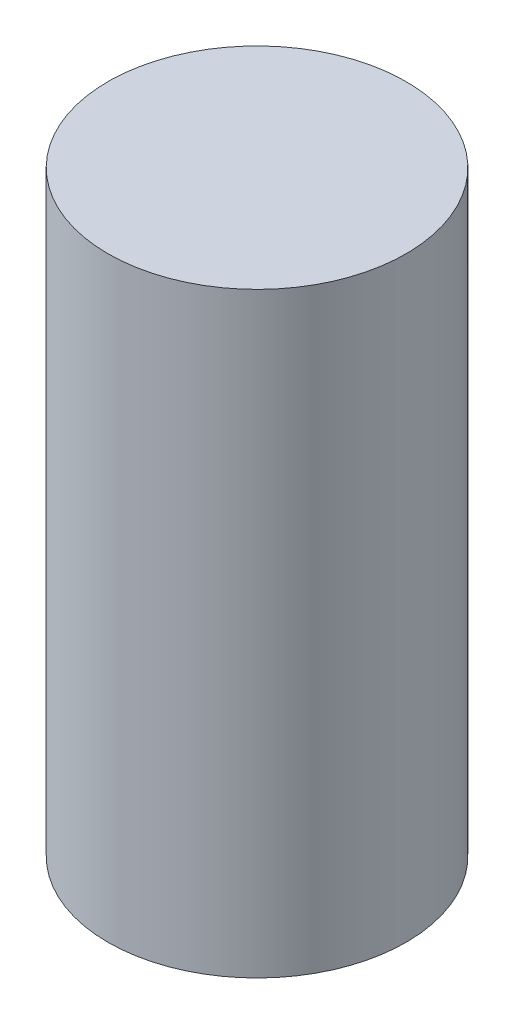
ISO-10303-21;
HEADER;
FILE_DESCRIPTION(('STEP AP214'),'2;1');
FILE_NAME('part.step','',(''),(''),'','','');
FILE_SCHEMA(('AUTOMOTIVE_DESIGN { 1 0 10303 214 1 1 1 1 }'));
ENDSEC;
DATA;
#1=APPLICATION_CONTEXT('core data for automotive mechanical design processes');
#2=APPLICATION_PROTOCOL_DEFINITION('international standard','automotive_design',2000,#1);
#3=PRODUCT_CONTEXT('',#1,'mechanical');
#4=PRODUCT('Part','Part','',(#3));
#5=PRODUCT_RELATED_PRODUCT_CATEGORY('part','',(#4));
#6=PRODUCT_DEFINITION_FORMATION('','',#4);
#7=PRODUCT_DEFINITION_CONTEXT('part definition',#1,'design');
#8=PRODUCT_DEFINITION('design','',#6,#7);
#9=PRODUCT_DEFINITION_SHAPE('','',#8);
#10=(LENGTH_UNIT() NAMED_UNIT(*) SI_UNIT(.MILLI.,.METRE.));
#11=(NAMED_UNIT(*) PLANE_ANGLE_UNIT() SI_UNIT($,.RADIAN.));
#12=(NAMED_UNIT(*) SI_UNIT($,.STERADIAN.) SOLID_ANGLE_UNIT());
#13=UNCERTAINTY_MEASURE_WITH_UNIT(LENGTH_MEASURE(1.E-05),#10,'distance_accuracy_value','');
#14=(GEOMETRIC_REPRESENTATION_CONTEXT(3) GLOBAL_UNCERTAINTY_ASSIGNED_CONTEXT((#13)) GLOBAL_UNIT_ASSIGNED_CONTEXT((#10,
#11,#12)) REPRESENTATION_CONTEXT('',''));
#15=CARTESIAN_POINT('',(0.,0.,0.));
#16=DIRECTION('',(0.,0.,1.));
#17=DIRECTION('',(1.,0.,0.));
#18=AXIS2_PLACEMENT_3D('',#15,#16,#17);
#19=CARTESIAN_POINT('',(0.,210.,0.));
#20=DIRECTION('',(0.,-1.,0.));
#21=DIRECTION('',(0.,0.,-1.));
#22=AXIS2_PLACEMENT_3D('',#19,#20,#21);
#23=CYLINDRICAL_SURFACE('',#22,52.5);
#24=CARTESIAN_POINT('',(0.,210.,0.));
#25=DIRECTION('',(0.,1.,0.));
#26=DIRECTION('',(0.,0.,1.));
#27=AXIS2_PLACEMENT_3D('',#24,#25,#26);
#28=CIRCLE('',#27,52.5);
#29=CARTESIAN_POINT('',(0.,210.,52.5));
#30=VERTEX_POINT('',#29);
#31=EDGE_CURVE('E10',#30,#30,#28,.T.);
#32=ORIENTED_EDGE('',*,*,#31,.F.);
#33=EDGE_LOOP('',(#32));
#34=FACE_BOUND('',#33,.T.);
#35=CARTESIAN_POINT('',(0.,0.,0.));
#36=DIRECTION('',(0.,1.,0.));
#37=DIRECTION('',(0.,0.,1.));
#38=AXIS2_PLACEMENT_3D('',#35,#36,#37);
#39=CIRCLE('',#38,52.5);
#40=CARTESIAN_POINT('',(0.,0.,52.5));
#41=VERTEX_POINT('',#40);
#42=EDGE_CURVE('E40',#41,#41,#39,.T.);
#43=ORIENTED_EDGE('',*,*,#42,.T.);
#44=EDGE_LOOP('',(#43));
#45=FACE_BOUND('',#44,.T.);
#46=ADVANCED_FACE('F37',(#34,#45),#23,.T.);
#47=CARTESIAN_POINT('',(0.,210.,0.));
#48=DIRECTION('',(0.,1.,0.));
#49=DIRECTION('',(0.,0.,1.));
#50=AXIS2_PLACEMENT_3D('',#47,#48,#49);
#51=PLANE('',#50);
#52=ORIENTED_EDGE('',*,*,#31,.T.);
#53=EDGE_LOOP('',(#52));
#54=FACE_BOUND('',#53,.T.);
#55=ADVANCED_FACE('F70',(#54),#51,.T.);
#56=CARTESIAN_POINT('',(0.,0.,0.));
#57=DIRECTION('',(0.,1.,0.));
#58=DIRECTION('',(0.,0.,1.));
#59=AXIS2_PLACEMENT_3D('',#56,#57,#58);
#60=PLANE('',#59);
#61=CARTESIAN_POINT('',(0.,0.,0.));
#62=DIRECTION('',(0.,-1.,0.));
#63=DIRECTION('',(0.,0.,-1.));
#64=AXIS2_PLACEMENT_3D('',#61,#62,#63);
#65=CIRCLE('',#64,42.);
#66=CARTESIAN_POINT('',(0.,0.,-42.));
#67=VERTEX_POINT('',#66);
#68=EDGE_CURVE('E51',#67,#67,#65,.T.);
#69=ORIENTED_EDGE('',*,*,#68,.F.);
#70=EDGE_LOOP('',(#69));
#71=FACE_BOUND('',#70,.T.);
#72=ORIENTED_EDGE('',*,*,#42,.F.);
#73=EDGE_LOOP('',(#72));
#74=FACE_BOUND('',#73,.T.);
#75=ADVANCED_FACE('F64',(#71,#74),#60,.F.);
#76=CARTESIAN_POINT('',(0.,196.,0.));
#77=DIRECTION('',(0.,-1.,0.));
#78=DIRECTION('',(0.,0.,-1.));
#79=AXIS2_PLACEMENT_3D('',#76,#77,#78);
#80=CYLINDRICAL_SURFACE('',#79,42.);
#81=CARTESIAN_POINT('',(0.,196.,0.));
#82=DIRECTION('',(0.,-1.,0.));
#83=DIRECTION('',(0.,0.,-1.));
#84=AXIS2_PLACEMENT_3D('',#81,#82,#83);
#85=CIRCLE('',#84,42.);
#86=CARTESIAN_POINT('',(0.,196.,-42.));
#87=VERTEX_POINT('',#86);
#88=EDGE_CURVE('E49',#87,#87,#85,.T.);
#89=ORIENTED_EDGE('',*,*,#88,.F.);
#90=EDGE_LOOP('',(#89));
#91=FACE_BOUND('',#90,.T.);
#92=ORIENTED_EDGE('',*,*,#68,.T.);
#93=EDGE_LOOP('',(#92));
#94=FACE_BOUND('',#93,.T.);
#95=ADVANCED_FACE('F61',(#91,#94),#80,.F.);
#96=CARTESIAN_POINT('',(0.,196.,0.));
#97=DIRECTION('',(0.,-1.,0.));
#98=DIRECTION('',(0.,0.,-1.));
#99=AXIS2_PLACEMENT_3D('',#96,#97,#98);
#100=PLANE('',#99);
#101=ORIENTED_EDGE('',*,*,#88,.T.);
#102=EDGE_LOOP('',(#101));
#103=FACE_BOUND('',#102,.T.);
#104=ADVANCED_FACE('F59',(#103),#100,.T.);
#105=CLOSED_SHELL('',(#46,#55,#75,#95,#104));
#106=MANIFOLD_SOLID_BREP('B2',#105);
#107=ADVANCED_BREP_SHAPE_REPRESENTATION('',(#18,#106),#14);
#108=SHAPE_DEFINITION_REPRESENTATION(#9,#107);
ENDSEC;
END-ISO-10303-21;
